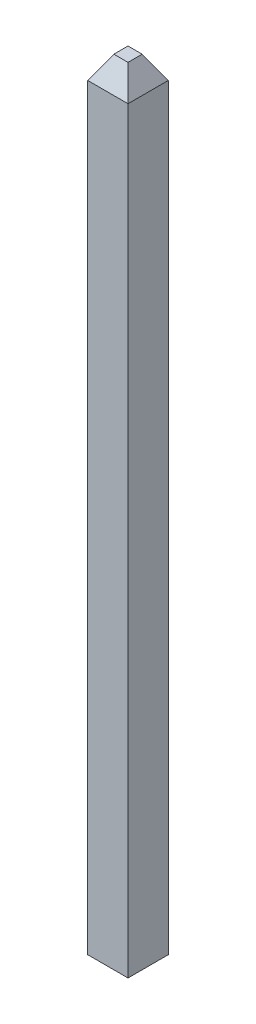
ISO-10303-21;
HEADER;
FILE_DESCRIPTION(('STEP AP214'),'2;1');
FILE_NAME('part.step','',(''),(''),'','','');
FILE_SCHEMA(('AUTOMOTIVE_DESIGN { 1 0 10303 214 1 1 1 1 }'));
ENDSEC;
DATA;
#1=APPLICATION_CONTEXT('core data for automotive mechanical design processes');
#2=APPLICATION_PROTOCOL_DEFINITION('international standard','automotive_design',2000,#1);
#3=PRODUCT_CONTEXT('',#1,'mechanical');
#4=PRODUCT('Part','Part','',(#3));
#5=PRODUCT_RELATED_PRODUCT_CATEGORY('part','',(#4));
#6=PRODUCT_DEFINITION_FORMATION('','',#4);
#7=PRODUCT_DEFINITION_CONTEXT('part definition',#1,'design');
#8=PRODUCT_DEFINITION('design','',#6,#7);
#9=PRODUCT_DEFINITION_SHAPE('','',#8);
#10=(LENGTH_UNIT() NAMED_UNIT(*) SI_UNIT(.MILLI.,.METRE.));
#11=(NAMED_UNIT(*) PLANE_ANGLE_UNIT() SI_UNIT($,.RADIAN.));
#12=(NAMED_UNIT(*) SI_UNIT($,.STERADIAN.) SOLID_ANGLE_UNIT());
#13=UNCERTAINTY_MEASURE_WITH_UNIT(LENGTH_MEASURE(1.E-05),#10,'distance_accuracy_value','');
#14=(GEOMETRIC_REPRESENTATION_CONTEXT(3) GLOBAL_UNCERTAINTY_ASSIGNED_CONTEXT((#13)) GLOBAL_UNIT_ASSIGNED_CONTEXT((#10,
#11,#12)) REPRESENTATION_CONTEXT('',''));
#15=CARTESIAN_POINT('',(0.,0.,0.));
#16=DIRECTION('',(0.,0.,1.));
#17=DIRECTION('',(1.,0.,0.));
#18=AXIS2_PLACEMENT_3D('',#15,#16,#17);
#19=CARTESIAN_POINT('',(41.105276717937,21.1582,-0.2032));
#20=DIRECTION('',(0.,0.,-1.));
#21=DIRECTION('',(0.,1.,0.));
#22=AXIS2_PLACEMENT_3D('',#19,#20,#21);
#23=PLANE('',#22);
#24=DIRECTION('',(0.,-1.,0.));
#25=VECTOR('',#24,1.);
#26=CARTESIAN_POINT('',(0.203199999999998,21.1582,-0.2032));
#27=LINE('',#26,#25);
#28=CARTESIAN_POINT('',(0.203199999999998,20.9296,-0.2032));
#29=VERTEX_POINT('',#28);
#30=CARTESIAN_POINT('',(0.203199999999997,13.3096,-0.2032));
#31=VERTEX_POINT('',#30);
#32=EDGE_CURVE('E76',#29,#31,#27,.T.);
#33=ORIENTED_EDGE('',*,*,#32,.T.);
#34=DIRECTION('',(-1.,0.,0.));
#35=VECTOR('',#34,1.);
#36=CARTESIAN_POINT('',(41.105276717937,13.3096,-0.2032));
#37=LINE('',#36,#35);
#38=CARTESIAN_POINT('',(-0.203200000000001,13.3096,-0.2032));
#39=VERTEX_POINT('',#38);
#40=EDGE_CURVE('E68',#31,#39,#37,.T.);
#41=ORIENTED_EDGE('',*,*,#40,.T.);
#42=DIRECTION('',(0.,-1.,0.));
#43=VECTOR('',#42,1.);
#44=CARTESIAN_POINT('',(-0.203200000000002,21.1582,-0.2032));
#45=LINE('',#44,#43);
#46=CARTESIAN_POINT('',(-0.203200000000002,20.9296,-0.2032));
#47=VERTEX_POINT('',#46);
#48=EDGE_CURVE('E73',#47,#39,#45,.T.);
#49=ORIENTED_EDGE('',*,*,#48,.F.);
#50=DIRECTION('',(1.,0.,0.));
#51=VECTOR('',#50,1.);
#52=CARTESIAN_POINT('',(0.203199999999998,20.9296,-0.2032));
#53=LINE('',#52,#51);
#54=EDGE_CURVE('E108',#47,#29,#53,.T.);
#55=ORIENTED_EDGE('',*,*,#54,.T.);
#56=EDGE_LOOP('',(#33,#41,#49,#55));
#57=FACE_BOUND('',#56,.T.);
#58=ADVANCED_FACE('F16',(#57),#23,.T.);
#59=CARTESIAN_POINT('',(41.105276717937,21.1582,0.2032));
#60=DIRECTION('',(0.,0.,-1.));
#61=DIRECTION('',(0.,1.,0.));
#62=AXIS2_PLACEMENT_3D('',#59,#60,#61);
#63=PLANE('',#62);
#64=DIRECTION('',(-1.,0.,0.));
#65=VECTOR('',#64,1.);
#66=CARTESIAN_POINT('',(41.105276717937,13.3096,0.2032));
#67=LINE('',#66,#65);
#68=CARTESIAN_POINT('',(0.203199999999997,13.3096,0.2032));
#69=VERTEX_POINT('',#68);
#70=CARTESIAN_POINT('',(-0.203200000000001,13.3096,0.2032));
#71=VERTEX_POINT('',#70);
#72=EDGE_CURVE('E30',#69,#71,#67,.T.);
#73=ORIENTED_EDGE('',*,*,#72,.F.);
#74=DIRECTION('',(0.,-1.,0.));
#75=VECTOR('',#74,1.);
#76=CARTESIAN_POINT('',(0.203199999999998,21.1582,0.2032));
#77=LINE('',#76,#75);
#78=CARTESIAN_POINT('',(0.203199999999998,20.9296,0.2032));
#79=VERTEX_POINT('',#78);
#80=EDGE_CURVE('E81',#79,#69,#77,.T.);
#81=ORIENTED_EDGE('',*,*,#80,.F.);
#82=DIRECTION('',(-1.,0.,0.));
#83=VECTOR('',#82,1.);
#84=CARTESIAN_POINT('',(41.105276717937,20.9296,0.2032));
#85=LINE('',#84,#83);
#86=CARTESIAN_POINT('',(-0.203200000000002,20.9296,0.2032));
#87=VERTEX_POINT('',#86);
#88=EDGE_CURVE('E23',#79,#87,#85,.T.);
#89=ORIENTED_EDGE('',*,*,#88,.T.);
#90=DIRECTION('',(0.,-1.,0.));
#91=VECTOR('',#90,1.);
#92=CARTESIAN_POINT('',(-0.203200000000002,21.1582,0.2032));
#93=LINE('',#92,#91);
#94=EDGE_CURVE('E82',#87,#71,#93,.T.);
#95=ORIENTED_EDGE('',*,*,#94,.T.);
#96=EDGE_LOOP('',(#73,#81,#89,#95));
#97=FACE_BOUND('',#96,.T.);
#98=ADVANCED_FACE('F112',(#97),#63,.F.);
#99=CARTESIAN_POINT('',(0.203199999999998,21.1582,-0.2032));
#100=DIRECTION('',(-1.,0.,0.));
#101=DIRECTION('',(0.,-1.,0.));
#102=AXIS2_PLACEMENT_3D('',#99,#100,#101);
#103=PLANE('',#102);
#104=DIRECTION('',(0.,0.,1.));
#105=VECTOR('',#104,1.);
#106=CARTESIAN_POINT('',(0.203199999999999,13.3096,-0.2032));
#107=LINE('',#106,#105);
#108=EDGE_CURVE('E77',#31,#69,#107,.T.);
#109=ORIENTED_EDGE('',*,*,#108,.F.);
#110=ORIENTED_EDGE('',*,*,#32,.F.);
#111=DIRECTION('',(0.,0.,1.));
#112=VECTOR('',#111,1.);
#113=CARTESIAN_POINT('',(0.203199999999998,20.9296,-0.2032));
#114=LINE('',#113,#112);
#115=EDGE_CURVE('E95',#29,#79,#114,.T.);
#116=ORIENTED_EDGE('',*,*,#115,.T.);
#117=ORIENTED_EDGE('',*,*,#80,.T.);
#118=EDGE_LOOP('',(#109,#110,#116,#117));
#119=FACE_BOUND('',#118,.T.);
#120=ADVANCED_FACE('F133',(#119),#103,.F.);
#121=CARTESIAN_POINT('',(-0.203200000000002,21.1582,-0.2032));
#122=DIRECTION('',(-1.,0.,0.));
#123=DIRECTION('',(0.,-1.,0.));
#124=AXIS2_PLACEMENT_3D('',#121,#122,#123);
#125=PLANE('',#124);
#126=ORIENTED_EDGE('',*,*,#48,.T.);
#127=DIRECTION('',(0.,0.,1.));
#128=VECTOR('',#127,1.);
#129=CARTESIAN_POINT('',(-0.203200000000001,13.3096,-0.2032));
#130=LINE('',#129,#128);
#131=EDGE_CURVE('E11',#39,#71,#130,.T.);
#132=ORIENTED_EDGE('',*,*,#131,.T.);
#133=ORIENTED_EDGE('',*,*,#94,.F.);
#134=DIRECTION('',(0.,0.,-1.));
#135=VECTOR('',#134,1.);
#136=CARTESIAN_POINT('',(-0.203200000000002,20.9296,-0.2032));
#137=LINE('',#136,#135);
#138=EDGE_CURVE('E37',#87,#47,#137,.T.);
#139=ORIENTED_EDGE('',*,*,#138,.T.);
#140=EDGE_LOOP('',(#126,#132,#133,#139));
#141=FACE_BOUND('',#140,.T.);
#142=ADVANCED_FACE('F79',(#141),#125,.T.);
#143=CARTESIAN_POINT('',(41.105276717937,21.1582,-0.2032));
#144=DIRECTION('',(0.,-1.,0.));
#145=DIRECTION('',(1.,0.,0.));
#146=AXIS2_PLACEMENT_3D('',#143,#144,#145);
#147=PLANE('',#146);
#148=DIRECTION('',(0.,0.,-1.));
#149=VECTOR('',#148,1.);
#150=CARTESIAN_POINT('',(0.0712177284632465,21.1582,-0.2032));
#151=LINE('',#150,#149);
#152=CARTESIAN_POINT('',(0.0712177284632468,21.1582,0.0712177284632491));
#153=VERTEX_POINT('',#152);
#154=CARTESIAN_POINT('',(0.0712177284632468,21.1582,-0.0712177284632491));
#155=VERTEX_POINT('',#154);
#156=EDGE_CURVE('E102',#153,#155,#151,.T.);
#157=ORIENTED_EDGE('',*,*,#156,.T.);
#158=DIRECTION('',(-1.,0.,0.));
#159=VECTOR('',#158,1.);
#160=CARTESIAN_POINT('',(-0.203200000000002,21.1582,-0.0712177284632491));
#161=LINE('',#160,#159);
#162=CARTESIAN_POINT('',(-0.0712177284632537,21.1582,-0.0712177284632491));
#163=VERTEX_POINT('',#162);
#164=EDGE_CURVE('E105',#155,#163,#161,.T.);
#165=ORIENTED_EDGE('',*,*,#164,.T.);
#166=DIRECTION('',(0.,0.,1.));
#167=VECTOR('',#166,1.);
#168=CARTESIAN_POINT('',(-0.0712177284632537,21.1582,0.2032));
#169=LINE('',#168,#167);
#170=CARTESIAN_POINT('',(-0.0712177284632537,21.1582,0.0712177284632491));
#171=VERTEX_POINT('',#170);
#172=EDGE_CURVE('E100',#163,#171,#169,.T.);
#173=ORIENTED_EDGE('',*,*,#172,.T.);
#174=DIRECTION('',(1.,0.,0.));
#175=VECTOR('',#174,1.);
#176=CARTESIAN_POINT('',(41.105276717937,21.1582,0.0712177284632491));
#177=LINE('',#176,#175);
#178=EDGE_CURVE('E98',#171,#153,#177,.T.);
#179=ORIENTED_EDGE('',*,*,#178,.T.);
#180=EDGE_LOOP('',(#157,#165,#173,#179));
#181=FACE_BOUND('',#180,.T.);
#182=ADVANCED_FACE('F141',(#181),#147,.F.);
#183=CARTESIAN_POINT('',(-0.0712177284632534,21.1582,-0.2032));
#184=DIRECTION('',(-0.866025403784441,0.499999999999996,0.));
#185=DIRECTION('',(-0.499999999999997,-0.866025403784441,0.));
#186=AXIS2_PLACEMENT_3D('',#183,#184,#185);
#187=PLANE('',#186);
#188=DIRECTION('',(0.447213595499954,0.774596669241483,-0.447213595499962));
#189=VECTOR('',#188,1.);
#190=CARTESIAN_POINT('',(8.05849534358724,35.2392760917485,-8.05849534358738));
#191=LINE('',#190,#189);
#192=EDGE_CURVE('E120',#171,#87,#191,.F.);
#193=ORIENTED_EDGE('',*,*,#192,.F.);
#194=ORIENTED_EDGE('',*,*,#172,.F.);
#195=DIRECTION('',(0.447213595499954,0.774596669241483,0.447213595499962));
#196=VECTOR('',#195,1.);
#197=CARTESIAN_POINT('',(8.16408116081663,35.4221560917485,8.16408116081679));
#198=LINE('',#197,#196);
#199=EDGE_CURVE('E90',#47,#163,#198,.T.);
#200=ORIENTED_EDGE('',*,*,#199,.F.);
#201=ORIENTED_EDGE('',*,*,#138,.F.);
#202=EDGE_LOOP('',(#193,#194,#200,#201));
#203=FACE_BOUND('',#202,.T.);
#204=ADVANCED_FACE('F118',(#203),#187,.T.);
#205=CARTESIAN_POINT('',(41.105276717937,21.1582,-0.0712177284632491));
#206=DIRECTION('',(0.,0.500000000000003,-0.866025403784437));
#207=DIRECTION('',(0.,0.866025403784437,0.500000000000003));
#208=AXIS2_PLACEMENT_3D('',#205,#206,#207);
#209=PLANE('',#208);
#210=ORIENTED_EDGE('',*,*,#199,.T.);
#211=ORIENTED_EDGE('',*,*,#164,.F.);
#212=DIRECTION('',(-0.447213595499962,0.77459666924148,0.44721359549996));
#213=VECTOR('',#212,1.);
#214=CARTESIAN_POINT('',(8.27802952635812,6.94358499789057,-8.27802952635809));
#215=LINE('',#214,#213);
#216=EDGE_CURVE('E125',#29,#155,#215,.T.);
#217=ORIENTED_EDGE('',*,*,#216,.F.);
#218=ORIENTED_EDGE('',*,*,#54,.F.);
#219=EDGE_LOOP('',(#210,#211,#217,#218));
#220=FACE_BOUND('',#219,.T.);
#221=ADVANCED_FACE('F143',(#220),#209,.T.);
#222=CARTESIAN_POINT('',(41.105276717937,20.9296,0.2032));
#223=DIRECTION('',(0.,-0.500000000000003,-0.866025403784437));
#224=DIRECTION('',(0.,0.866025403784437,-0.500000000000003));
#225=AXIS2_PLACEMENT_3D('',#222,#223,#224);
#226=PLANE('',#225);
#227=ORIENTED_EDGE('',*,*,#192,.T.);
#228=ORIENTED_EDGE('',*,*,#88,.F.);
#229=DIRECTION('',(-0.447213595499962,0.77459666924148,-0.44721359549996));
#230=VECTOR('',#229,1.);
#231=CARTESIAN_POINT('',(8.38361534358753,6.76070499789057,8.38361534358749));
#232=LINE('',#231,#230);
#233=EDGE_CURVE('E127',#153,#79,#232,.F.);
#234=ORIENTED_EDGE('',*,*,#233,.F.);
#235=ORIENTED_EDGE('',*,*,#178,.F.);
#236=EDGE_LOOP('',(#227,#228,#234,#235));
#237=FACE_BOUND('',#236,.T.);
#238=ADVANCED_FACE('F124',(#237),#226,.F.);
#239=CARTESIAN_POINT('',(0.203199999999998,20.9296,-0.2032));
#240=DIRECTION('',(-0.866025403784436,-0.500000000000005,0.));
#241=DIRECTION('',(0.500000000000005,-0.866025403784436,0.));
#242=AXIS2_PLACEMENT_3D('',#239,#240,#241);
#243=PLANE('',#242);
#244=ORIENTED_EDGE('',*,*,#216,.T.);
#245=ORIENTED_EDGE('',*,*,#156,.F.);
#246=ORIENTED_EDGE('',*,*,#233,.T.);
#247=ORIENTED_EDGE('',*,*,#115,.F.);
#248=EDGE_LOOP('',(#244,#245,#246,#247));
#249=FACE_BOUND('',#248,.T.);
#250=ADVANCED_FACE('F137',(#249),#243,.F.);
#251=CARTESIAN_POINT('',(-5.715,13.3096,-2.60408385953263));
#252=DIRECTION('',(0.,-1.,0.));
#253=DIRECTION('',(0.,0.,-1.));
#254=AXIS2_PLACEMENT_3D('',#251,#252,#253);
#255=PLANE('',#254);
#256=ORIENTED_EDGE('',*,*,#108,.T.);
#257=ORIENTED_EDGE('',*,*,#72,.T.);
#258=ORIENTED_EDGE('',*,*,#131,.F.);
#259=ORIENTED_EDGE('',*,*,#40,.F.);
#260=EDGE_LOOP('',(#256,#257,#258,#259));
#261=FACE_BOUND('',#260,.T.);
#262=ADVANCED_FACE('F67',(#261),#255,.T.);
#263=CLOSED_SHELL('',(#58,#98,#120,#142,#182,#204,#221,#238,#250,#262));
#264=MANIFOLD_SOLID_BREP('B1',#263);
#265=ADVANCED_BREP_SHAPE_REPRESENTATION('',(#18,#264),#14);
#266=SHAPE_DEFINITION_REPRESENTATION(#9,#265);
ENDSEC;
END-ISO-10303-21;
